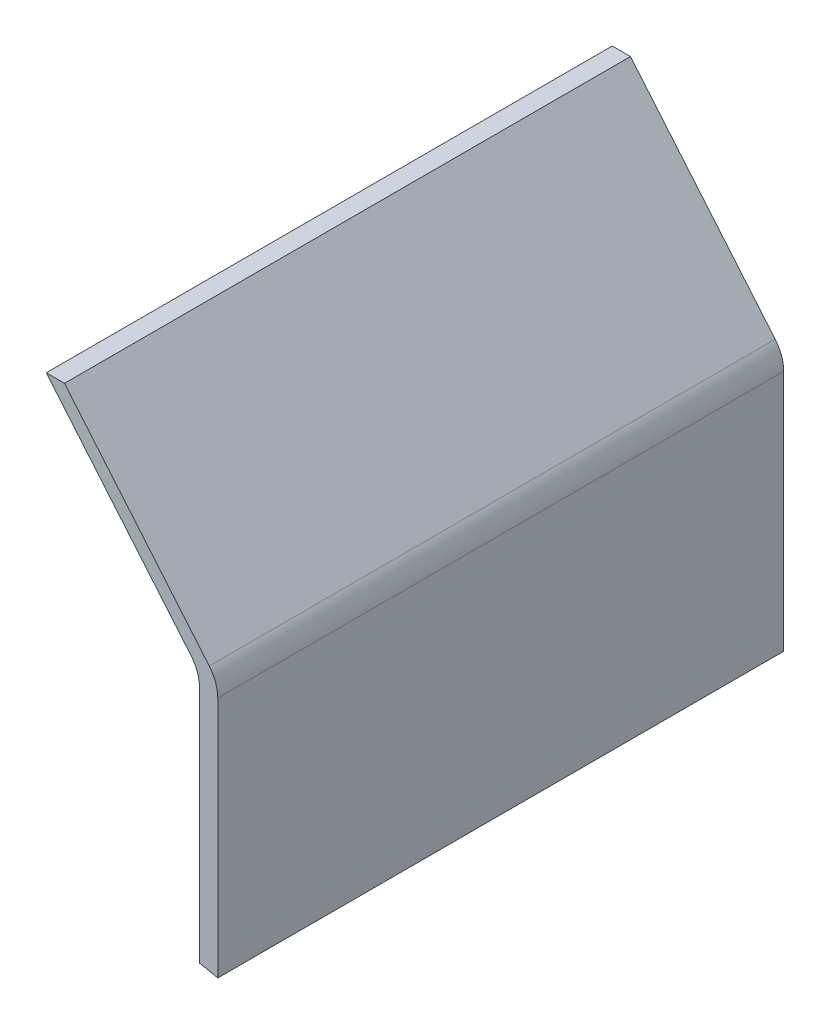
ISO-10303-21;
HEADER;
FILE_DESCRIPTION(('STEP AP214'),'2;1');
FILE_NAME('part.step','',(''),(''),'','','');
FILE_SCHEMA(('AUTOMOTIVE_DESIGN { 1 0 10303 214 1 1 1 1 }'));
ENDSEC;
DATA;
#1=APPLICATION_CONTEXT('core data for automotive mechanical design processes');
#2=APPLICATION_PROTOCOL_DEFINITION('international standard','automotive_design',2000,#1);
#3=PRODUCT_CONTEXT('',#1,'mechanical');
#4=PRODUCT('Part','Part','',(#3));
#5=PRODUCT_RELATED_PRODUCT_CATEGORY('part','',(#4));
#6=PRODUCT_DEFINITION_FORMATION('','',#4);
#7=PRODUCT_DEFINITION_CONTEXT('part definition',#1,'design');
#8=PRODUCT_DEFINITION('design','',#6,#7);
#9=PRODUCT_DEFINITION_SHAPE('','',#8);
#10=(LENGTH_UNIT() NAMED_UNIT(*) SI_UNIT(.MILLI.,.METRE.));
#11=(NAMED_UNIT(*) PLANE_ANGLE_UNIT() SI_UNIT($,.RADIAN.));
#12=(NAMED_UNIT(*) SI_UNIT($,.STERADIAN.) SOLID_ANGLE_UNIT());
#13=UNCERTAINTY_MEASURE_WITH_UNIT(LENGTH_MEASURE(1.E-05),#10,'distance_accuracy_value','');
#14=(GEOMETRIC_REPRESENTATION_CONTEXT(3) GLOBAL_UNCERTAINTY_ASSIGNED_CONTEXT((#13)) GLOBAL_UNIT_ASSIGNED_CONTEXT((#10,
#11,#12)) REPRESENTATION_CONTEXT('',''));
#15=CARTESIAN_POINT('',(0.,0.,0.));
#16=DIRECTION('',(0.,0.,1.));
#17=DIRECTION('',(1.,0.,0.));
#18=AXIS2_PLACEMENT_3D('',#15,#16,#17);
#19=CARTESIAN_POINT('',(-35.,-156.12494995996,155.));
#20=DIRECTION('',(0.,0.,-1.));
#21=DIRECTION('',(-1.,0.,0.));
#22=AXIS2_PLACEMENT_3D('',#19,#20,#21);
#23=CYLINDRICAL_SURFACE('',#22,160.);
#24=CARTESIAN_POINT('',(-35.,-156.12494995996,0.));
#25=DIRECTION('',(0.,0.,-1.));
#26=DIRECTION('',(1.,0.,0.));
#27=AXIS2_PLACEMENT_3D('',#24,#25,#26);
#28=CIRCLE('',#27,160.);
#29=CARTESIAN_POINT('',(-4.99999999999999,1.03738649505716,0.));
#30=VERTEX_POINT('',#29);
#31=CARTESIAN_POINT('',(0.,0.,0.));
#32=VERTEX_POINT('',#31);
#33=EDGE_CURVE('E129',#30,#32,#28,.T.);
#34=ORIENTED_EDGE('',*,*,#33,.T.);
#35=DIRECTION('',(0.,0.,-1.));
#36=VECTOR('',#35,1.);
#37=CARTESIAN_POINT('',(0.,0.,155.));
#38=LINE('',#37,#36);
#39=CARTESIAN_POINT('',(0.,0.,155.));
#40=VERTEX_POINT('',#39);
#41=EDGE_CURVE('E110',#40,#32,#38,.T.);
#42=ORIENTED_EDGE('',*,*,#41,.F.);
#43=CARTESIAN_POINT('',(-35.,-156.12494995996,155.));
#44=DIRECTION('',(0.,0.,-1.));
#45=DIRECTION('',(1.,0.,0.));
#46=AXIS2_PLACEMENT_3D('',#43,#44,#45);
#47=CIRCLE('',#46,160.);
#48=CARTESIAN_POINT('',(-4.99999999999999,1.03738649505716,155.));
#49=VERTEX_POINT('',#48);
#50=EDGE_CURVE('E117',#49,#40,#47,.T.);
#51=ORIENTED_EDGE('',*,*,#50,.F.);
#52=DIRECTION('',(0.,0.,-1.));
#53=VECTOR('',#52,1.);
#54=CARTESIAN_POINT('',(-4.99999999999999,1.03738649505716,155.));
#55=LINE('',#54,#53);
#56=EDGE_CURVE('E174',#49,#30,#55,.T.);
#57=ORIENTED_EDGE('',*,*,#56,.T.);
#58=EDGE_LOOP('',(#34,#42,#51,#57));
#59=FACE_BOUND('',#58,.T.);
#60=ADVANCED_FACE('F39',(#59),#23,.F.);
#61=CARTESIAN_POINT('',(0.,70.0373864950572,155.));
#62=DIRECTION('',(-1.,0.,0.));
#63=DIRECTION('',(0.,-1.,0.));
#64=AXIS2_PLACEMENT_3D('',#61,#62,#63);
#65=PLANE('',#64);
#66=DIRECTION('',(0.,1.,0.));
#67=VECTOR('',#66,1.);
#68=CARTESIAN_POINT('',(0.,70.0373864950572,0.));
#69=LINE('',#68,#67);
#70=CARTESIAN_POINT('',(0.,66.3976841523951,0.));
#71=VERTEX_POINT('',#70);
#72=EDGE_CURVE('E187',#32,#71,#69,.T.);
#73=ORIENTED_EDGE('',*,*,#72,.T.);
#74=DIRECTION('',(0.,0.,-1.));
#75=VECTOR('',#74,1.);
#76=CARTESIAN_POINT('',(0.,66.3976841523951,155.));
#77=LINE('',#76,#75);
#78=CARTESIAN_POINT('',(0.,66.3976841523951,155.));
#79=VERTEX_POINT('',#78);
#80=EDGE_CURVE('E113',#71,#79,#77,.F.);
#81=ORIENTED_EDGE('',*,*,#80,.T.);
#82=DIRECTION('',(0.,1.,0.));
#83=VECTOR('',#82,1.);
#84=CARTESIAN_POINT('',(0.,70.0373864950572,155.));
#85=LINE('',#84,#83);
#86=EDGE_CURVE('E105',#40,#79,#85,.T.);
#87=ORIENTED_EDGE('',*,*,#86,.F.);
#88=ORIENTED_EDGE('',*,*,#41,.T.);
#89=EDGE_LOOP('',(#73,#81,#87,#88));
#90=FACE_BOUND('',#89,.T.);
#91=ADVANCED_FACE('F108',(#90),#65,.F.);
#92=CARTESIAN_POINT('',(-41.9740309125311,120.060088630726,155.));
#93=DIRECTION('',(-0.766044443118977,-0.64278760968654,0.));
#94=DIRECTION('',(0.64278760968654,-0.766044443118977,0.));
#95=AXIS2_PLACEMENT_3D('',#92,#93,#94);
#96=PLANE('',#95);
#97=DIRECTION('',(-0.64278760968654,0.766044443118977,0.));
#98=VECTOR('',#97,1.);
#99=CARTESIAN_POINT('',(-41.9740309125311,120.060088630726,155.));
#100=LINE('',#99,#98);
#101=CARTESIAN_POINT('',(-2.33955556881023,72.8255602492605,155.));
#102=VERTEX_POINT('',#101);
#103=CARTESIAN_POINT('',(-41.9740309125311,120.060088630726,155.));
#104=VERTEX_POINT('',#103);
#105=EDGE_CURVE('E116',#102,#104,#100,.T.);
#106=ORIENTED_EDGE('',*,*,#105,.F.);
#107=DIRECTION('',(0.,0.,-1.));
#108=VECTOR('',#107,1.);
#109=CARTESIAN_POINT('',(-2.33955556881022,72.8255602492605,155.));
#110=LINE('',#109,#108);
#111=CARTESIAN_POINT('',(-2.33955556881023,72.8255602492605,0.));
#112=VERTEX_POINT('',#111);
#113=EDGE_CURVE('E131',#102,#112,#110,.T.);
#114=ORIENTED_EDGE('',*,*,#113,.T.);
#115=DIRECTION('',(-0.64278760968654,0.766044443118977,0.));
#116=VECTOR('',#115,1.);
#117=CARTESIAN_POINT('',(-41.9740309125311,120.060088630726,0.));
#118=LINE('',#117,#116);
#119=CARTESIAN_POINT('',(-41.9740309125311,120.060088630726,0.));
#120=VERTEX_POINT('',#119);
#121=EDGE_CURVE('E190',#112,#120,#118,.T.);
#122=ORIENTED_EDGE('',*,*,#121,.T.);
#123=DIRECTION('',(0.,0.,-1.));
#124=VECTOR('',#123,1.);
#125=CARTESIAN_POINT('',(-41.9740309125311,120.060088630726,155.));
#126=LINE('',#125,#124);
#127=EDGE_CURVE('E132',#104,#120,#126,.T.);
#128=ORIENTED_EDGE('',*,*,#127,.F.);
#129=EDGE_LOOP('',(#106,#114,#122,#128));
#130=FACE_BOUND('',#129,.T.);
#131=ADVANCED_FACE('F206',(#130),#96,.F.);
#132=CARTESIAN_POINT('',(-46.9740309125311,120.060088630726,155.));
#133=DIRECTION('',(0.,-1.,0.));
#134=DIRECTION('',(1.,0.,0.));
#135=AXIS2_PLACEMENT_3D('',#132,#133,#134);
#136=PLANE('',#135);
#137=DIRECTION('',(-1.,0.,0.));
#138=VECTOR('',#137,1.);
#139=CARTESIAN_POINT('',(-46.9740309125311,120.060088630726,0.));
#140=LINE('',#139,#138);
#141=CARTESIAN_POINT('',(-46.9740309125311,120.060088630726,0.));
#142=VERTEX_POINT('',#141);
#143=EDGE_CURVE('E170',#120,#142,#140,.T.);
#144=ORIENTED_EDGE('',*,*,#143,.T.);
#145=DIRECTION('',(0.,0.,-1.));
#146=VECTOR('',#145,1.);
#147=CARTESIAN_POINT('',(-46.9740309125311,120.060088630726,155.));
#148=LINE('',#147,#146);
#149=CARTESIAN_POINT('',(-46.9740309125311,120.060088630726,155.));
#150=VERTEX_POINT('',#149);
#151=EDGE_CURVE('E140',#150,#142,#148,.T.);
#152=ORIENTED_EDGE('',*,*,#151,.F.);
#153=DIRECTION('',(-1.,0.,0.));
#154=VECTOR('',#153,1.);
#155=CARTESIAN_POINT('',(-46.9740309125311,120.060088630726,155.));
#156=LINE('',#155,#154);
#157=EDGE_CURVE('E181',#104,#150,#156,.T.);
#158=ORIENTED_EDGE('',*,*,#157,.F.);
#159=ORIENTED_EDGE('',*,*,#127,.T.);
#160=EDGE_LOOP('',(#144,#152,#158,#159));
#161=FACE_BOUND('',#160,.T.);
#162=ADVANCED_FACE('F204',(#161),#136,.F.);
#163=CARTESIAN_POINT('',(-4.99999999999999,70.0373864950572,155.));
#164=DIRECTION('',(0.766044443118977,0.64278760968654,0.));
#165=DIRECTION('',(-0.64278760968654,0.766044443118977,0.));
#166=AXIS2_PLACEMENT_3D('',#163,#164,#165);
#167=PLANE('',#166);
#168=DIRECTION('',(0.64278760968654,-0.766044443118977,0.));
#169=VECTOR('',#168,1.);
#170=CARTESIAN_POINT('',(-4.99999999999999,70.0373864950572,0.));
#171=LINE('',#170,#169);
#172=CARTESIAN_POINT('',(-7.33955556881022,72.8255602492605,0.));
#173=VERTEX_POINT('',#172);
#174=EDGE_CURVE('E163',#142,#173,#171,.T.);
#175=ORIENTED_EDGE('',*,*,#174,.T.);
#176=DIRECTION('',(0.,0.,-1.));
#177=VECTOR('',#176,1.);
#178=CARTESIAN_POINT('',(-7.33955556881022,72.8255602492605,155.));
#179=LINE('',#178,#177);
#180=CARTESIAN_POINT('',(-7.33955556881022,72.8255602492605,155.));
#181=VERTEX_POINT('',#180);
#182=EDGE_CURVE('E61',#173,#181,#179,.F.);
#183=ORIENTED_EDGE('',*,*,#182,.T.);
#184=DIRECTION('',(0.64278760968654,-0.766044443118977,0.));
#185=VECTOR('',#184,1.);
#186=CARTESIAN_POINT('',(-4.99999999999999,70.0373864950572,155.));
#187=LINE('',#186,#185);
#188=EDGE_CURVE('E176',#150,#181,#187,.T.);
#189=ORIENTED_EDGE('',*,*,#188,.F.);
#190=ORIENTED_EDGE('',*,*,#151,.T.);
#191=EDGE_LOOP('',(#175,#183,#189,#190));
#192=FACE_BOUND('',#191,.T.);
#193=ADVANCED_FACE('F167',(#192),#167,.F.);
#194=CARTESIAN_POINT('',(-4.99999999999999,1.03738649505716,155.));
#195=DIRECTION('',(1.,0.,0.));
#196=DIRECTION('',(0.,1.,0.));
#197=AXIS2_PLACEMENT_3D('',#194,#195,#196);
#198=PLANE('',#197);
#199=DIRECTION('',(0.,-1.,0.));
#200=VECTOR('',#199,1.);
#201=CARTESIAN_POINT('',(-4.99999999999999,1.03738649505716,155.));
#202=LINE('',#201,#200);
#203=CARTESIAN_POINT('',(-4.99999999999999,66.3976841523951,155.));
#204=VERTEX_POINT('',#203);
#205=EDGE_CURVE('E121',#204,#49,#202,.T.);
#206=ORIENTED_EDGE('',*,*,#205,.F.);
#207=DIRECTION('',(0.,0.,-1.));
#208=VECTOR('',#207,1.);
#209=CARTESIAN_POINT('',(-4.99999999999999,66.3976841523951,0.));
#210=LINE('',#209,#208);
#211=CARTESIAN_POINT('',(-4.99999999999999,66.3976841523951,0.));
#212=VERTEX_POINT('',#211);
#213=EDGE_CURVE('E151',#204,#212,#210,.T.);
#214=ORIENTED_EDGE('',*,*,#213,.T.);
#215=DIRECTION('',(0.,-1.,0.));
#216=VECTOR('',#215,1.);
#217=CARTESIAN_POINT('',(-4.99999999999999,1.03738649505716,0.));
#218=LINE('',#217,#216);
#219=EDGE_CURVE('E126',#212,#30,#218,.T.);
#220=ORIENTED_EDGE('',*,*,#219,.T.);
#221=ORIENTED_EDGE('',*,*,#56,.F.);
#222=EDGE_LOOP('',(#206,#214,#220,#221));
#223=FACE_BOUND('',#222,.T.);
#224=ADVANCED_FACE('F173',(#223),#198,.F.);
#225=CARTESIAN_POINT('',(-35.,-156.12494995996,155.));
#226=DIRECTION('',(0.,0.,1.));
#227=DIRECTION('',(1.,0.,0.));
#228=AXIS2_PLACEMENT_3D('',#225,#226,#227);
#229=PLANE('',#228);
#230=ORIENTED_EDGE('',*,*,#86,.T.);
#231=CARTESIAN_POINT('',(-10.,66.3976841523951,155.));
#232=DIRECTION('',(0.,0.,1.));
#233=DIRECTION('',(1.,0.,0.));
#234=AXIS2_PLACEMENT_3D('',#231,#232,#233);
#235=CIRCLE('',#234,10.);
#236=EDGE_CURVE('E148',#79,#102,#235,.T.);
#237=ORIENTED_EDGE('',*,*,#236,.T.);
#238=ORIENTED_EDGE('',*,*,#105,.T.);
#239=ORIENTED_EDGE('',*,*,#157,.T.);
#240=ORIENTED_EDGE('',*,*,#188,.T.);
#241=CARTESIAN_POINT('',(-15.,66.3976841523951,155.));
#242=DIRECTION('',(0.,0.,1.));
#243=DIRECTION('',(1.,0.,0.));
#244=AXIS2_PLACEMENT_3D('',#241,#242,#243);
#245=CIRCLE('',#244,10.);
#246=EDGE_CURVE('E11',#181,#204,#245,.F.);
#247=ORIENTED_EDGE('',*,*,#246,.T.);
#248=ORIENTED_EDGE('',*,*,#205,.T.);
#249=ORIENTED_EDGE('',*,*,#50,.T.);
#250=EDGE_LOOP('',(#230,#237,#238,#239,#240,#247,#248,#249));
#251=FACE_BOUND('',#250,.T.);
#252=ADVANCED_FACE('F120',(#251),#229,.T.);
#253=CARTESIAN_POINT('',(-35.,-156.12494995996,0.));
#254=DIRECTION('',(0.,0.,1.));
#255=DIRECTION('',(1.,0.,0.));
#256=AXIS2_PLACEMENT_3D('',#253,#254,#255);
#257=PLANE('',#256);
#258=ORIENTED_EDGE('',*,*,#121,.F.);
#259=CARTESIAN_POINT('',(-10.,66.3976841523951,0.));
#260=DIRECTION('',(0.,0.,1.));
#261=DIRECTION('',(1.,0.,0.));
#262=AXIS2_PLACEMENT_3D('',#259,#260,#261);
#263=CIRCLE('',#262,10.);
#264=EDGE_CURVE('E137',#112,#71,#263,.F.);
#265=ORIENTED_EDGE('',*,*,#264,.T.);
#266=ORIENTED_EDGE('',*,*,#72,.F.);
#267=ORIENTED_EDGE('',*,*,#33,.F.);
#268=ORIENTED_EDGE('',*,*,#219,.F.);
#269=CARTESIAN_POINT('',(-15.,66.3976841523951,0.));
#270=DIRECTION('',(0.,0.,1.));
#271=DIRECTION('',(1.,0.,0.));
#272=AXIS2_PLACEMENT_3D('',#269,#270,#271);
#273=CIRCLE('',#272,10.);
#274=EDGE_CURVE('E48',#212,#173,#273,.T.);
#275=ORIENTED_EDGE('',*,*,#274,.T.);
#276=ORIENTED_EDGE('',*,*,#174,.F.);
#277=ORIENTED_EDGE('',*,*,#143,.F.);
#278=EDGE_LOOP('',(#258,#265,#266,#267,#268,#275,#276,#277));
#279=FACE_BOUND('',#278,.T.);
#280=ADVANCED_FACE('F161',(#279),#257,.F.);
#281=CARTESIAN_POINT('',(-10.,66.3976841523951,155.));
#282=DIRECTION('',(0.,0.,-1.));
#283=DIRECTION('',(-1.,0.,0.));
#284=AXIS2_PLACEMENT_3D('',#281,#282,#283);
#285=CYLINDRICAL_SURFACE('',#284,10.);
#286=ORIENTED_EDGE('',*,*,#236,.F.);
#287=ORIENTED_EDGE('',*,*,#80,.F.);
#288=ORIENTED_EDGE('',*,*,#264,.F.);
#289=ORIENTED_EDGE('',*,*,#113,.F.);
#290=EDGE_LOOP('',(#286,#287,#288,#289));
#291=FACE_BOUND('',#290,.T.);
#292=ADVANCED_FACE('F209',(#291),#285,.T.);
#293=CARTESIAN_POINT('',(-15.,66.3976841523951,155.));
#294=DIRECTION('',(0.,0.,1.));
#295=DIRECTION('',(1.,0.,0.));
#296=AXIS2_PLACEMENT_3D('',#293,#294,#295);
#297=CYLINDRICAL_SURFACE('',#296,10.);
#298=ORIENTED_EDGE('',*,*,#246,.F.);
#299=ORIENTED_EDGE('',*,*,#182,.F.);
#300=ORIENTED_EDGE('',*,*,#274,.F.);
#301=ORIENTED_EDGE('',*,*,#213,.F.);
#302=EDGE_LOOP('',(#298,#299,#300,#301));
#303=FACE_BOUND('',#302,.T.);
#304=ADVANCED_FACE('F41',(#303),#297,.F.);
#305=CLOSED_SHELL('',(#60,#91,#131,#162,#193,#224,#252,#280,#292,#304));
#306=MANIFOLD_SOLID_BREP('B2',#305);
#307=ADVANCED_BREP_SHAPE_REPRESENTATION('',(#18,#306),#14);
#308=SHAPE_DEFINITION_REPRESENTATION(#9,#307);
ENDSEC;
END-ISO-10303-21;
